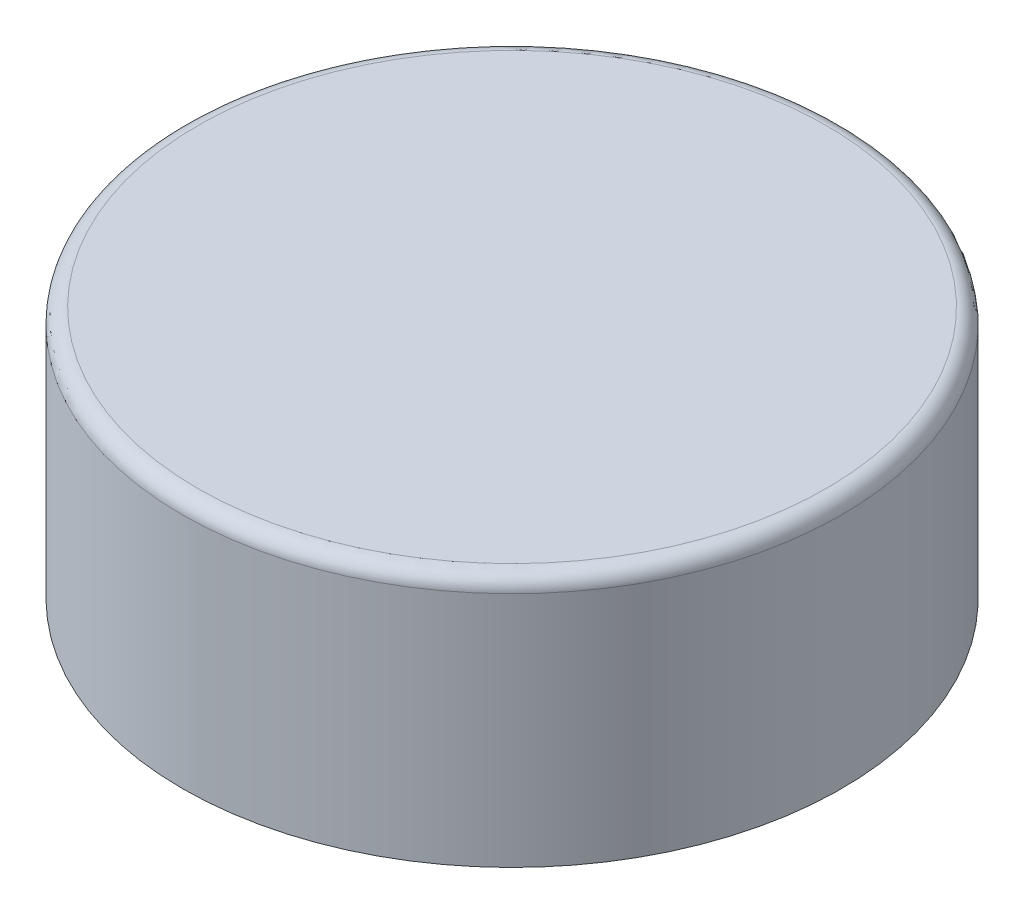
ISO-10303-21;
HEADER;
FILE_DESCRIPTION(('STEP AP214'),'2;1');
FILE_NAME('part.step','',(''),(''),'','','');
FILE_SCHEMA(('AUTOMOTIVE_DESIGN { 1 0 10303 214 1 1 1 1 }'));
ENDSEC;
DATA;
#1=APPLICATION_CONTEXT('core data for automotive mechanical design processes');
#2=APPLICATION_PROTOCOL_DEFINITION('international standard','automotive_design',2000,#1);
#3=PRODUCT_CONTEXT('',#1,'mechanical');
#4=PRODUCT('Part','Part','',(#3));
#5=PRODUCT_RELATED_PRODUCT_CATEGORY('part','',(#4));
#6=PRODUCT_DEFINITION_FORMATION('','',#4);
#7=PRODUCT_DEFINITION_CONTEXT('part definition',#1,'design');
#8=PRODUCT_DEFINITION('design','',#6,#7);
#9=PRODUCT_DEFINITION_SHAPE('','',#8);
#10=(LENGTH_UNIT() NAMED_UNIT(*) SI_UNIT(.MILLI.,.METRE.));
#11=(NAMED_UNIT(*) PLANE_ANGLE_UNIT() SI_UNIT($,.RADIAN.));
#12=(NAMED_UNIT(*) SI_UNIT($,.STERADIAN.) SOLID_ANGLE_UNIT());
#13=UNCERTAINTY_MEASURE_WITH_UNIT(LENGTH_MEASURE(1.E-05),#10,'distance_accuracy_value','');
#14=(GEOMETRIC_REPRESENTATION_CONTEXT(3) GLOBAL_UNCERTAINTY_ASSIGNED_CONTEXT((#13)) GLOBAL_UNIT_ASSIGNED_CONTEXT((#10,
#11,#12)) REPRESENTATION_CONTEXT('',''));
#15=CARTESIAN_POINT('',(0.,0.,0.));
#16=DIRECTION('',(0.,0.,1.));
#17=DIRECTION('',(1.,0.,0.));
#18=AXIS2_PLACEMENT_3D('',#15,#16,#17);
#19=CARTESIAN_POINT('',(0.,-33.,0.));
#20=DIRECTION('',(0.,1.,0.));
#21=DIRECTION('',(0.,0.,1.));
#22=AXIS2_PLACEMENT_3D('',#19,#20,#21);
#23=CYLINDRICAL_SURFACE('',#22,40.1);
#24=CARTESIAN_POINT('',(0.,-5.,0.));
#25=DIRECTION('',(0.,1.,0.));
#26=DIRECTION('',(0.,0.,1.));
#27=AXIS2_PLACEMENT_3D('',#24,#25,#26);
#28=CIRCLE('',#27,40.1);
#29=CARTESIAN_POINT('',(0.,-5.,40.1));
#30=VERTEX_POINT('',#29);
#31=EDGE_CURVE('E48',#30,#30,#28,.T.);
#32=ORIENTED_EDGE('',*,*,#31,.T.);
#33=EDGE_LOOP('',(#32));
#34=FACE_BOUND('',#33,.T.);
#35=CARTESIAN_POINT('',(0.,-33.,0.));
#36=DIRECTION('',(0.,1.,0.));
#37=DIRECTION('',(0.,0.,1.));
#38=AXIS2_PLACEMENT_3D('',#35,#36,#37);
#39=CIRCLE('',#38,40.1);
#40=CARTESIAN_POINT('',(0.,-33.,40.1));
#41=VERTEX_POINT('',#40);
#42=EDGE_CURVE('E60',#41,#41,#39,.T.);
#43=ORIENTED_EDGE('',*,*,#42,.F.);
#44=EDGE_LOOP('',(#43));
#45=FACE_BOUND('',#44,.T.);
#46=ADVANCED_FACE('F37',(#34,#45),#23,.F.);
#47=CARTESIAN_POINT('',(0.,-33.,0.));
#48=DIRECTION('',(0.,1.,0.));
#49=DIRECTION('',(0.,0.,1.));
#50=AXIS2_PLACEMENT_3D('',#47,#48,#49);
#51=CYLINDRICAL_SURFACE('',#50,43.1);
#52=CARTESIAN_POINT('',(0.,-2.,0.));
#53=DIRECTION('',(0.,1.,0.));
#54=DIRECTION('',(0.,0.,1.));
#55=AXIS2_PLACEMENT_3D('',#52,#53,#54);
#56=CIRCLE('',#55,43.1);
#57=CARTESIAN_POINT('',(0.,-2.,43.1));
#58=VERTEX_POINT('',#57);
#59=EDGE_CURVE('E10',#58,#58,#56,.F.);
#60=ORIENTED_EDGE('',*,*,#59,.T.);
#61=EDGE_LOOP('',(#60));
#62=FACE_BOUND('',#61,.T.);
#63=CARTESIAN_POINT('',(0.,-33.,0.));
#64=DIRECTION('',(0.,1.,0.));
#65=DIRECTION('',(0.,0.,1.));
#66=AXIS2_PLACEMENT_3D('',#63,#64,#65);
#67=CIRCLE('',#66,43.1);
#68=CARTESIAN_POINT('',(0.,-33.,43.1));
#69=VERTEX_POINT('',#68);
#70=EDGE_CURVE('E57',#69,#69,#67,.T.);
#71=ORIENTED_EDGE('',*,*,#70,.T.);
#72=EDGE_LOOP('',(#71));
#73=FACE_BOUND('',#72,.T.);
#74=ADVANCED_FACE('F68',(#62,#73),#51,.T.);
#75=CARTESIAN_POINT('',(0.,-33.,0.));
#76=DIRECTION('',(0.,1.,0.));
#77=DIRECTION('',(0.,0.,1.));
#78=AXIS2_PLACEMENT_3D('',#75,#76,#77);
#79=PLANE('',#78);
#80=ORIENTED_EDGE('',*,*,#42,.T.);
#81=EDGE_LOOP('',(#80));
#82=FACE_BOUND('',#81,.T.);
#83=ORIENTED_EDGE('',*,*,#70,.F.);
#84=EDGE_LOOP('',(#83));
#85=FACE_BOUND('',#84,.T.);
#86=ADVANCED_FACE('F64',(#82,#85),#79,.F.);
#87=CARTESIAN_POINT('',(0.,0.,0.));
#88=DIRECTION('',(0.,1.,0.));
#89=DIRECTION('',(0.,0.,1.));
#90=AXIS2_PLACEMENT_3D('',#87,#88,#89);
#91=PLANE('',#90);
#92=CARTESIAN_POINT('',(0.,0.,0.));
#93=DIRECTION('',(0.,1.,0.));
#94=DIRECTION('',(0.,0.,1.));
#95=AXIS2_PLACEMENT_3D('',#92,#93,#94);
#96=CIRCLE('',#95,41.1);
#97=CARTESIAN_POINT('',(0.,0.,41.1));
#98=VERTEX_POINT('',#97);
#99=EDGE_CURVE('E44',#98,#98,#96,.T.);
#100=ORIENTED_EDGE('',*,*,#99,.T.);
#101=EDGE_LOOP('',(#100));
#102=FACE_BOUND('',#101,.T.);
#103=ADVANCED_FACE('F80',(#102),#91,.T.);
#104=CARTESIAN_POINT('',(0.,-3.,0.));
#105=DIRECTION('',(0.,1.,0.));
#106=DIRECTION('',(0.,0.,1.));
#107=AXIS2_PLACEMENT_3D('',#104,#105,#106);
#108=PLANE('',#107);
#109=CARTESIAN_POINT('',(0.,-3.,0.));
#110=DIRECTION('',(0.,1.,0.));
#111=DIRECTION('',(0.,0.,1.));
#112=AXIS2_PLACEMENT_3D('',#109,#110,#111);
#113=CIRCLE('',#112,38.1);
#114=CARTESIAN_POINT('',(0.,-3.,38.1));
#115=VERTEX_POINT('',#114);
#116=EDGE_CURVE('E52',#115,#115,#113,.F.);
#117=ORIENTED_EDGE('',*,*,#116,.T.);
#118=EDGE_LOOP('',(#117));
#119=FACE_BOUND('',#118,.T.);
#120=ADVANCED_FACE('F77',(#119),#108,.F.);
#121=CARTESIAN_POINT('',(0.,-5.,0.));
#122=DIRECTION('',(0.,1.,0.));
#123=DIRECTION('',(0.,0.,1.));
#124=AXIS2_PLACEMENT_3D('',#121,#122,#123);
#125=TOROIDAL_SURFACE('',#124,38.1,2.);
#126=ORIENTED_EDGE('',*,*,#31,.F.);
#127=EDGE_LOOP('',(#126));
#128=FACE_BOUND('',#127,.T.);
#129=ORIENTED_EDGE('',*,*,#116,.F.);
#130=EDGE_LOOP('',(#129));
#131=FACE_BOUND('',#130,.T.);
#132=ADVANCED_FACE('F82',(#128,#131),#125,.F.);
#133=CARTESIAN_POINT('',(0.,-2.,0.));
#134=DIRECTION('',(0.,1.,0.));
#135=DIRECTION('',(0.,0.,1.));
#136=AXIS2_PLACEMENT_3D('',#133,#134,#135);
#137=TOROIDAL_SURFACE('',#136,41.1,2.);
#138=ORIENTED_EDGE('',*,*,#59,.F.);
#139=EDGE_LOOP('',(#138));
#140=FACE_BOUND('',#139,.T.);
#141=ORIENTED_EDGE('',*,*,#99,.F.);
#142=EDGE_LOOP('',(#141));
#143=FACE_BOUND('',#142,.T.);
#144=ADVANCED_FACE('F39',(#140,#143),#137,.T.);
#145=CLOSED_SHELL('',(#46,#74,#86,#103,#120,#132,#144));
#146=MANIFOLD_SOLID_BREP('B2',#145);
#147=ADVANCED_BREP_SHAPE_REPRESENTATION('',(#18,#146),#14);
#148=SHAPE_DEFINITION_REPRESENTATION(#9,#147);
ENDSEC;
END-ISO-10303-21;
